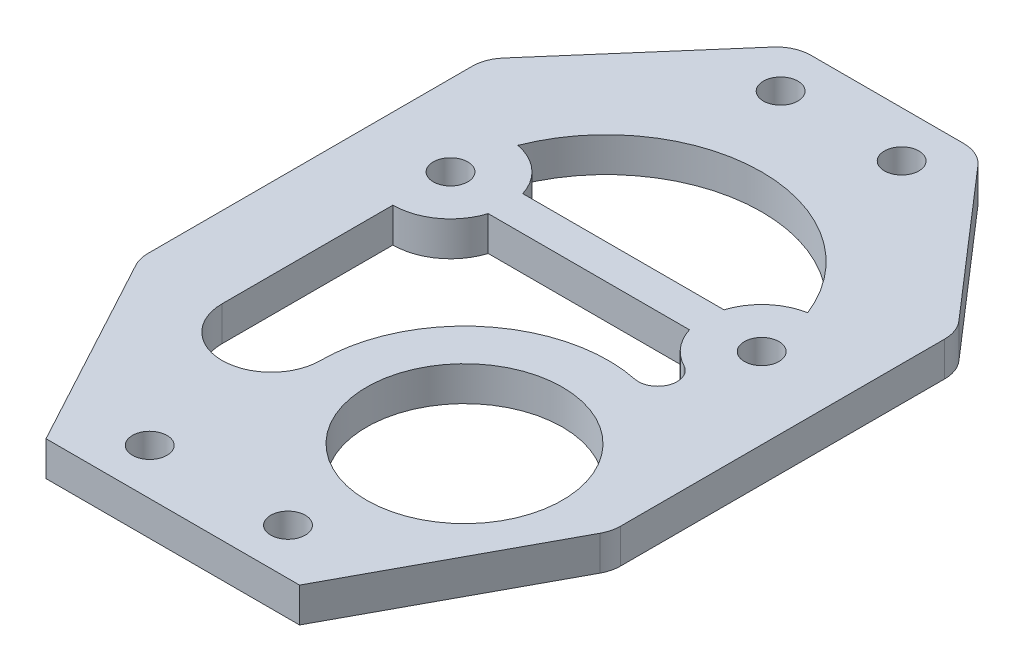
ISO-10303-21;
HEADER;
FILE_DESCRIPTION(('STEP AP214'),'2;1');
FILE_NAME('part.step','',(''),(''),'','','');
FILE_SCHEMA(('AUTOMOTIVE_DESIGN { 1 0 10303 214 1 1 1 1 }'));
ENDSEC;
DATA;
#1=APPLICATION_CONTEXT('core data for automotive mechanical design processes');
#2=APPLICATION_PROTOCOL_DEFINITION('international standard','automotive_design',2000,#1);
#3=PRODUCT_CONTEXT('',#1,'mechanical');
#4=PRODUCT('Part','Part','',(#3));
#5=PRODUCT_RELATED_PRODUCT_CATEGORY('part','',(#4));
#6=PRODUCT_DEFINITION_FORMATION('','',#4);
#7=PRODUCT_DEFINITION_CONTEXT('part definition',#1,'design');
#8=PRODUCT_DEFINITION('design','',#6,#7);
#9=PRODUCT_DEFINITION_SHAPE('','',#8);
#10=(LENGTH_UNIT() NAMED_UNIT(*) SI_UNIT(.MILLI.,.METRE.));
#11=(NAMED_UNIT(*) PLANE_ANGLE_UNIT() SI_UNIT($,.RADIAN.));
#12=(NAMED_UNIT(*) SI_UNIT($,.STERADIAN.) SOLID_ANGLE_UNIT());
#13=UNCERTAINTY_MEASURE_WITH_UNIT(LENGTH_MEASURE(1.E-05),#10,'distance_accuracy_value','');
#14=(GEOMETRIC_REPRESENTATION_CONTEXT(3) GLOBAL_UNCERTAINTY_ASSIGNED_CONTEXT((#13)) GLOBAL_UNIT_ASSIGNED_CONTEXT((#10,
#11,#12)) REPRESENTATION_CONTEXT('',''));
#15=CARTESIAN_POINT('',(0.,0.,0.));
#16=DIRECTION('',(0.,0.,1.));
#17=DIRECTION('',(1.,0.,0.));
#18=AXIS2_PLACEMENT_3D('',#15,#16,#17);
#19=CARTESIAN_POINT('',(0.,1.5,0.));
#20=DIRECTION('',(0.,-1.,0.));
#21=DIRECTION('',(0.,0.,-1.));
#22=AXIS2_PLACEMENT_3D('',#19,#20,#21);
#23=PLANE('',#22);
#24=CARTESIAN_POINT('',(13.5,1.5,0.));
#25=DIRECTION('',(0.,1.,0.));
#26=DIRECTION('',(0.,0.,1.));
#27=AXIS2_PLACEMENT_3D('',#24,#25,#26);
#28=CIRCLE('',#27,1.5);
#29=CARTESIAN_POINT('',(13.5,1.5,1.5));
#30=VERTEX_POINT('',#29);
#31=EDGE_CURVE('E267',#30,#30,#28,.T.);
#32=ORIENTED_EDGE('',*,*,#31,.F.);
#33=EDGE_LOOP('',(#32));
#34=FACE_BOUND('',#33,.T.);
#35=CARTESIAN_POINT('',(-13.5,1.5,0.));
#36=DIRECTION('',(0.,1.,0.));
#37=DIRECTION('',(0.,0.,1.));
#38=AXIS2_PLACEMENT_3D('',#35,#36,#37);
#39=CIRCLE('',#38,1.5);
#40=CARTESIAN_POINT('',(-13.5,1.5,1.5));
#41=VERTEX_POINT('',#40);
#42=EDGE_CURVE('E273',#41,#41,#39,.T.);
#43=ORIENTED_EDGE('',*,*,#42,.F.);
#44=EDGE_LOOP('',(#43));
#45=FACE_BOUND('',#44,.T.);
#46=CARTESIAN_POINT('',(13.5,1.5,0.));
#47=DIRECTION('',(0.,-1.,0.));
#48=DIRECTION('',(0.,0.,1.));
#49=AXIS2_PLACEMENT_3D('',#46,#47,#48);
#50=CIRCLE('',#49,5.);
#51=CARTESIAN_POINT('',(8.73030399291527,1.5,-1.5));
#52=VERTEX_POINT('',#51);
#53=CARTESIAN_POINT('',(12.5740740740741,1.5,-4.91351820793393));
#54=VERTEX_POINT('',#53);
#55=EDGE_CURVE('E279',#52,#54,#50,.T.);
#56=ORIENTED_EDGE('',*,*,#55,.F.);
#57=DIRECTION('',(1.,0.,0.));
#58=VECTOR('',#57,1.);
#59=CARTESIAN_POINT('',(8.73030399291527,1.5,-1.5));
#60=LINE('',#59,#58);
#61=CARTESIAN_POINT('',(-8.73030399291527,1.5,-1.5));
#62=VERTEX_POINT('',#61);
#63=EDGE_CURVE('E287',#62,#52,#60,.T.);
#64=ORIENTED_EDGE('',*,*,#63,.F.);
#65=CARTESIAN_POINT('',(-13.5,1.5,0.));
#66=DIRECTION('',(0.,-1.,0.));
#67=DIRECTION('',(0.,0.,1.));
#68=AXIS2_PLACEMENT_3D('',#65,#66,#67);
#69=CIRCLE('',#68,5.);
#70=CARTESIAN_POINT('',(-12.5740740740741,1.5,-4.91351820793393));
#71=VERTEX_POINT('',#70);
#72=EDGE_CURVE('E284',#71,#62,#69,.T.);
#73=ORIENTED_EDGE('',*,*,#72,.F.);
#74=CARTESIAN_POINT('',(0.,1.5,0.));
#75=DIRECTION('',(0.,1.,0.));
#76=DIRECTION('',(0.,0.,1.));
#77=AXIS2_PLACEMENT_3D('',#74,#75,#76);
#78=CIRCLE('',#77,13.5);
#79=EDGE_CURVE('E281',#54,#71,#78,.T.);
#80=ORIENTED_EDGE('',*,*,#79,.F.);
#81=EDGE_LOOP('',(#56,#64,#73,#80));
#82=FACE_BOUND('',#81,.T.);
#83=DIRECTION('',(0.,0.,1.));
#84=VECTOR('',#83,1.);
#85=CARTESIAN_POINT('',(-20.5,1.5,-10.));
#86=LINE('',#85,#84);
#87=CARTESIAN_POINT('',(-20.5,1.5,-8.87956217000711));
#88=VERTEX_POINT('',#87);
#89=CARTESIAN_POINT('',(-20.5,1.5,19.2420155495152));
#90=VERTEX_POINT('',#89);
#91=EDGE_CURVE('E351',#88,#90,#86,.T.);
#92=ORIENTED_EDGE('',*,*,#91,.T.);
#93=CARTESIAN_POINT('',(-17.5,1.5,19.2420155495152));
#94=DIRECTION('',(0.,-1.,0.));
#95=DIRECTION('',(0.,0.,-1.));
#96=AXIS2_PLACEMENT_3D('',#93,#94,#95);
#97=CIRCLE('',#96,3.);
#98=CARTESIAN_POINT('',(-20.1399573860197,1.5,20.6670155495152));
#99=VERTEX_POINT('',#98);
#100=EDGE_CURVE('E411',#90,#99,#97,.F.);
#101=ORIENTED_EDGE('',*,*,#100,.T.);
#102=DIRECTION('',(0.475,0.,0.879985795339902));
#103=VECTOR('',#102,1.);
#104=CARTESIAN_POINT('',(-20.5,1.5,20.));
#105=LINE('',#104,#103);
#106=CARTESIAN_POINT('',(-11.,1.5,37.599715906798));
#107=VERTEX_POINT('',#106);
#108=EDGE_CURVE('E354',#99,#107,#105,.T.);
#109=ORIENTED_EDGE('',*,*,#108,.T.);
#110=DIRECTION('',(1.,0.,0.));
#111=VECTOR('',#110,1.);
#112=CARTESIAN_POINT('',(-11.,1.5,37.599715906798));
#113=LINE('',#112,#111);
#114=CARTESIAN_POINT('',(11.,1.5,37.599715906798));
#115=VERTEX_POINT('',#114);
#116=EDGE_CURVE('E334',#107,#115,#113,.T.);
#117=ORIENTED_EDGE('',*,*,#116,.T.);
#118=DIRECTION('',(0.475,0.,-0.879985795339902));
#119=VECTOR('',#118,1.);
#120=CARTESIAN_POINT('',(20.5,1.5,20.));
#121=LINE('',#120,#119);
#122=CARTESIAN_POINT('',(20.1399573860197,1.5,20.6670155495152));
#123=VERTEX_POINT('',#122);
#124=EDGE_CURVE('E337',#115,#123,#121,.T.);
#125=ORIENTED_EDGE('',*,*,#124,.T.);
#126=CARTESIAN_POINT('',(17.5,1.5,19.2420155495152));
#127=DIRECTION('',(0.,-1.,0.));
#128=DIRECTION('',(0.,0.,-1.));
#129=AXIS2_PLACEMENT_3D('',#126,#127,#128);
#130=CIRCLE('',#129,3.);
#131=CARTESIAN_POINT('',(20.5,1.5,19.2420155495152));
#132=VERTEX_POINT('',#131);
#133=EDGE_CURVE('E402',#123,#132,#130,.F.);
#134=ORIENTED_EDGE('',*,*,#133,.T.);
#135=DIRECTION('',(0.,0.,-1.));
#136=VECTOR('',#135,1.);
#137=CARTESIAN_POINT('',(20.5,1.5,-10.));
#138=LINE('',#137,#136);
#139=CARTESIAN_POINT('',(20.5,1.5,-8.87956217000711));
#140=VERTEX_POINT('',#139);
#141=EDGE_CURVE('E341',#132,#140,#138,.T.);
#142=ORIENTED_EDGE('',*,*,#141,.T.);
#143=CARTESIAN_POINT('',(17.5,1.5,-8.87956217000711));
#144=DIRECTION('',(0.,-1.,0.));
#145=DIRECTION('',(0.,0.,-1.));
#146=AXIS2_PLACEMENT_3D('',#143,#144,#145);
#147=CIRCLE('',#146,3.);
#148=CARTESIAN_POINT('',(19.7655284444291,1.5,-10.8461279246878));
#149=VERTEX_POINT('',#148);
#150=EDGE_CURVE('E404',#140,#149,#147,.F.);
#151=ORIENTED_EDGE('',*,*,#150,.T.);
#152=DIRECTION('',(-0.655521918226887,0.,-0.755176148143029));
#153=VECTOR('',#152,1.);
#154=CARTESIAN_POINT('',(8.,1.5,-24.400284093202));
#155=LINE('',#154,#153);
#156=CARTESIAN_POINT('',(8.89706064011543,1.5,-23.3668498478826));
#157=VERTEX_POINT('',#156);
#158=EDGE_CURVE('E344',#149,#157,#155,.T.);
#159=ORIENTED_EDGE('',*,*,#158,.T.);
#160=CARTESIAN_POINT('',(6.63153219568634,1.5,-21.400284093202));
#161=DIRECTION('',(0.,-1.,0.));
#162=DIRECTION('',(0.,0.,-1.));
#163=AXIS2_PLACEMENT_3D('',#160,#161,#162);
#164=CIRCLE('',#163,3.);
#165=CARTESIAN_POINT('',(6.63153219568634,1.5,-24.400284093202));
#166=VERTEX_POINT('',#165);
#167=EDGE_CURVE('E406',#157,#166,#164,.F.);
#168=ORIENTED_EDGE('',*,*,#167,.T.);
#169=DIRECTION('',(-1.,0.,0.));
#170=VECTOR('',#169,1.);
#171=CARTESIAN_POINT('',(8.,1.5,-24.400284093202));
#172=LINE('',#171,#170);
#173=CARTESIAN_POINT('',(-6.63153219568634,1.5,-24.400284093202));
#174=VERTEX_POINT('',#173);
#175=EDGE_CURVE('E347',#166,#174,#172,.T.);
#176=ORIENTED_EDGE('',*,*,#175,.T.);
#177=CARTESIAN_POINT('',(-6.63153219568634,1.5,-21.400284093202));
#178=DIRECTION('',(0.,-1.,0.));
#179=DIRECTION('',(0.,0.,-1.));
#180=AXIS2_PLACEMENT_3D('',#177,#178,#179);
#181=CIRCLE('',#180,3.);
#182=CARTESIAN_POINT('',(-8.89706064011543,1.5,-23.3668498478826));
#183=VERTEX_POINT('',#182);
#184=EDGE_CURVE('E54',#174,#183,#181,.F.);
#185=ORIENTED_EDGE('',*,*,#184,.T.);
#186=DIRECTION('',(-0.655521918226887,0.,0.755176148143029));
#187=VECTOR('',#186,1.);
#188=CARTESIAN_POINT('',(-8.,1.5,-24.400284093202));
#189=LINE('',#188,#187);
#190=CARTESIAN_POINT('',(-19.7655284444291,1.5,-10.8461279246878));
#191=VERTEX_POINT('',#190);
#192=EDGE_CURVE('E349',#183,#191,#189,.T.);
#193=ORIENTED_EDGE('',*,*,#192,.T.);
#194=CARTESIAN_POINT('',(-17.5,1.5,-8.87956217000711));
#195=DIRECTION('',(0.,-1.,0.));
#196=DIRECTION('',(0.,0.,-1.));
#197=AXIS2_PLACEMENT_3D('',#194,#195,#196);
#198=CIRCLE('',#197,3.);
#199=EDGE_CURVE('E409',#191,#88,#198,.F.);
#200=ORIENTED_EDGE('',*,*,#199,.T.);
#201=EDGE_LOOP('',(#92,#101,#109,#117,#125,#134,#142,#151,#159,#168,#176,#185,#193,#200));
#202=FACE_BOUND('',#201,.T.);
#203=CARTESIAN_POINT('',(-5.25,1.5,-20.3945458395131));
#204=DIRECTION('',(0.,1.,0.));
#205=DIRECTION('',(0.,0.,1.));
#206=AXIS2_PLACEMENT_3D('',#203,#204,#205);
#207=CIRCLE('',#206,1.5);
#208=CARTESIAN_POINT('',(-5.25,1.5,-18.8945458395131));
#209=VERTEX_POINT('',#208);
#210=EDGE_CURVE('E328',#209,#209,#207,.T.);
#211=ORIENTED_EDGE('',*,*,#210,.F.);
#212=EDGE_LOOP('',(#211));
#213=FACE_BOUND('',#212,.T.);
#214=CARTESIAN_POINT('',(-5.99999999999999,1.5,33.599715906798));
#215=DIRECTION('',(0.,1.,0.));
#216=DIRECTION('',(0.,0.,1.));
#217=AXIS2_PLACEMENT_3D('',#214,#215,#216);
#218=CIRCLE('',#217,1.5);
#219=CARTESIAN_POINT('',(-5.99999999999999,1.5,35.099715906798));
#220=VERTEX_POINT('',#219);
#221=EDGE_CURVE('E322',#220,#220,#218,.T.);
#222=ORIENTED_EDGE('',*,*,#221,.F.);
#223=EDGE_LOOP('',(#222));
#224=FACE_BOUND('',#223,.T.);
#225=CARTESIAN_POINT('',(6.,1.5,33.599715906798));
#226=DIRECTION('',(0.,1.,0.));
#227=DIRECTION('',(0.,0.,-1.));
#228=AXIS2_PLACEMENT_3D('',#225,#226,#227);
#229=CIRCLE('',#228,1.5);
#230=CARTESIAN_POINT('',(6.,1.5,32.099715906798));
#231=VERTEX_POINT('',#230);
#232=EDGE_CURVE('E316',#231,#231,#229,.T.);
#233=ORIENTED_EDGE('',*,*,#232,.F.);
#234=EDGE_LOOP('',(#233));
#235=FACE_BOUND('',#234,.T.);
#236=CARTESIAN_POINT('',(5.25,1.5,-20.3945458395131));
#237=DIRECTION('',(0.,1.,0.));
#238=DIRECTION('',(0.,0.,-1.));
#239=AXIS2_PLACEMENT_3D('',#236,#237,#238);
#240=CIRCLE('',#239,1.5);
#241=CARTESIAN_POINT('',(5.25,1.5,-21.8945458395131));
#242=VERTEX_POINT('',#241);
#243=EDGE_CURVE('E310',#242,#242,#240,.T.);
#244=ORIENTED_EDGE('',*,*,#243,.F.);
#245=EDGE_LOOP('',(#244));
#246=FACE_BOUND('',#245,.T.);
#247=CARTESIAN_POINT('',(-9.23491832320444,1.5,19.8174147720394));
#248=DIRECTION('',(0.,1.,0.));
#249=DIRECTION('',(0.,0.,1.));
#250=AXIS2_PLACEMENT_3D('',#247,#248,#249);
#251=CIRCLE('',#250,4.26508167679556);
#252=CARTESIAN_POINT('',(-13.5,1.5,19.8174147720394));
#253=VERTEX_POINT('',#252);
#254=CARTESIAN_POINT('',(-4.96983664640886,1.5,19.8174147720394));
#255=VERTEX_POINT('',#254);
#256=EDGE_CURVE('E201',#253,#255,#251,.T.);
#257=ORIENTED_EDGE('',*,*,#256,.F.);
#258=DIRECTION('',(0.,0.,1.));
#259=VECTOR('',#258,1.);
#260=CARTESIAN_POINT('',(-13.5,1.5,5.));
#261=LINE('',#260,#259);
#262=CARTESIAN_POINT('',(-13.5,1.5,5.));
#263=VERTEX_POINT('',#262);
#264=EDGE_CURVE('E237',#263,#253,#261,.T.);
#265=ORIENTED_EDGE('',*,*,#264,.F.);
#266=CARTESIAN_POINT('',(-13.5,1.5,0.));
#267=DIRECTION('',(0.,-1.,0.));
#268=DIRECTION('',(0.,0.,1.));
#269=AXIS2_PLACEMENT_3D('',#266,#267,#268);
#270=CIRCLE('',#269,5.);
#271=CARTESIAN_POINT('',(-8.73030399291527,1.5,1.5));
#272=VERTEX_POINT('',#271);
#273=EDGE_CURVE('E234',#272,#263,#270,.T.);
#274=ORIENTED_EDGE('',*,*,#273,.F.);
#275=DIRECTION('',(-1.,0.,0.));
#276=VECTOR('',#275,1.);
#277=CARTESIAN_POINT('',(8.73030399291527,1.5,1.5));
#278=LINE('',#277,#276);
#279=CARTESIAN_POINT('',(8.73030399291527,1.5,1.5));
#280=VERTEX_POINT('',#279);
#281=EDGE_CURVE('E232',#280,#272,#278,.T.);
#282=ORIENTED_EDGE('',*,*,#281,.F.);
#283=CARTESIAN_POINT('',(13.5,1.5,0.));
#284=DIRECTION('',(0.,-1.,0.));
#285=DIRECTION('',(0.,0.,1.));
#286=AXIS2_PLACEMENT_3D('',#283,#284,#285);
#287=CIRCLE('',#286,5.);
#288=CARTESIAN_POINT('',(11.1879757809718,1.5,4.43334456258784));
#289=VERTEX_POINT('',#288);
#290=EDGE_CURVE('E227',#289,#280,#287,.T.);
#291=ORIENTED_EDGE('',*,*,#290,.F.);
#292=CARTESIAN_POINT('',(10.4087781028521,1.5,5.92746895844948));
#293=DIRECTION('',(0.,1.,0.));
#294=DIRECTION('',(0.,0.,1.));
#295=AXIS2_PLACEMENT_3D('',#292,#293,#294);
#296=CIRCLE('',#295,1.68509843388926);
#297=CARTESIAN_POINT('',(10.0668171902538,1.5,7.57750515991627));
#298=VERTEX_POINT('',#297);
#299=EDGE_CURVE('E225',#298,#289,#296,.T.);
#300=ORIENTED_EDGE('',*,*,#299,.F.);
#301=CARTESIAN_POINT('',(7.53016335359115,1.5,19.8174147720394));
#302=DIRECTION('',(0.,-1.,0.));
#303=DIRECTION('',(0.,0.,-1.));
#304=AXIS2_PLACEMENT_3D('',#301,#302,#303);
#305=CIRCLE('',#304,12.5);
#306=EDGE_CURVE('E211',#255,#298,#305,.T.);
#307=ORIENTED_EDGE('',*,*,#306,.F.);
#308=EDGE_LOOP('',(#257,#265,#274,#282,#291,#300,#307));
#309=FACE_BOUND('',#308,.T.);
#310=CARTESIAN_POINT('',(7.53016335359115,1.5,19.8174147720394));
#311=DIRECTION('',(0.,1.,0.));
#312=DIRECTION('',(0.,0.,1.));
#313=AXIS2_PLACEMENT_3D('',#310,#311,#312);
#314=CIRCLE('',#313,8.5);
#315=CARTESIAN_POINT('',(7.53016335359115,1.5,28.3174147720394));
#316=VERTEX_POINT('',#315);
#317=EDGE_CURVE('E241',#316,#316,#314,.T.);
#318=ORIENTED_EDGE('',*,*,#317,.F.);
#319=EDGE_LOOP('',(#318));
#320=FACE_BOUND('',#319,.T.);
#321=ADVANCED_FACE('F32',(#34,#45,#82,#202,#213,#224,#235,#246,#309,#320),#23,.F.);
#322=CARTESIAN_POINT('',(0.,-1.5,0.));
#323=DIRECTION('',(0.,-1.,0.));
#324=DIRECTION('',(0.,0.,-1.));
#325=AXIS2_PLACEMENT_3D('',#322,#323,#324);
#326=PLANE('',#325);
#327=DIRECTION('',(0.,0.,1.));
#328=VECTOR('',#327,1.);
#329=CARTESIAN_POINT('',(-13.5,-1.5,5.));
#330=LINE('',#329,#328);
#331=CARTESIAN_POINT('',(-13.5,-1.5,5.));
#332=VERTEX_POINT('',#331);
#333=CARTESIAN_POINT('',(-13.5,-1.5,19.8174147720394));
#334=VERTEX_POINT('',#333);
#335=EDGE_CURVE('E212',#332,#334,#330,.T.);
#336=ORIENTED_EDGE('',*,*,#335,.T.);
#337=CARTESIAN_POINT('',(-9.23491832320444,-1.5,19.8174147720394));
#338=DIRECTION('',(0.,1.,0.));
#339=DIRECTION('',(0.,0.,1.));
#340=AXIS2_PLACEMENT_3D('',#337,#338,#339);
#341=CIRCLE('',#340,4.26508167679556);
#342=CARTESIAN_POINT('',(-4.96983664640886,-1.5,19.8174147720394));
#343=VERTEX_POINT('',#342);
#344=EDGE_CURVE('E239',#334,#343,#341,.T.);
#345=ORIENTED_EDGE('',*,*,#344,.T.);
#346=CARTESIAN_POINT('',(7.53016335359115,-1.5,19.8174147720394));
#347=DIRECTION('',(0.,-1.,0.));
#348=DIRECTION('',(0.,0.,-1.));
#349=AXIS2_PLACEMENT_3D('',#346,#347,#348);
#350=CIRCLE('',#349,12.5);
#351=CARTESIAN_POINT('',(10.0668171902538,-1.5,7.57750515991627));
#352=VERTEX_POINT('',#351);
#353=EDGE_CURVE('E218',#343,#352,#350,.T.);
#354=ORIENTED_EDGE('',*,*,#353,.T.);
#355=CARTESIAN_POINT('',(10.4087781028521,-1.5,5.92746895844948));
#356=DIRECTION('',(0.,1.,0.));
#357=DIRECTION('',(0.,0.,1.));
#358=AXIS2_PLACEMENT_3D('',#355,#356,#357);
#359=CIRCLE('',#358,1.68509843388926);
#360=CARTESIAN_POINT('',(11.1879757809718,-1.5,4.43334456258784));
#361=VERTEX_POINT('',#360);
#362=EDGE_CURVE('E243',#352,#361,#359,.T.);
#363=ORIENTED_EDGE('',*,*,#362,.T.);
#364=CARTESIAN_POINT('',(13.5,-1.5,0.));
#365=DIRECTION('',(0.,-1.,0.));
#366=DIRECTION('',(0.,0.,1.));
#367=AXIS2_PLACEMENT_3D('',#364,#365,#366);
#368=CIRCLE('',#367,5.);
#369=CARTESIAN_POINT('',(8.73030399291527,-1.5,1.5));
#370=VERTEX_POINT('',#369);
#371=EDGE_CURVE('E246',#361,#370,#368,.T.);
#372=ORIENTED_EDGE('',*,*,#371,.T.);
#373=DIRECTION('',(-1.,0.,0.));
#374=VECTOR('',#373,1.);
#375=CARTESIAN_POINT('',(8.73030399291527,-1.5,1.5));
#376=LINE('',#375,#374);
#377=CARTESIAN_POINT('',(-8.73030399291527,-1.5,1.5));
#378=VERTEX_POINT('',#377);
#379=EDGE_CURVE('E249',#370,#378,#376,.T.);
#380=ORIENTED_EDGE('',*,*,#379,.T.);
#381=CARTESIAN_POINT('',(-13.5,-1.5,0.));
#382=DIRECTION('',(0.,-1.,0.));
#383=DIRECTION('',(0.,0.,1.));
#384=AXIS2_PLACEMENT_3D('',#381,#382,#383);
#385=CIRCLE('',#384,5.);
#386=EDGE_CURVE('E252',#378,#332,#385,.T.);
#387=ORIENTED_EDGE('',*,*,#386,.T.);
#388=EDGE_LOOP('',(#336,#345,#354,#363,#372,#380,#387));
#389=FACE_BOUND('',#388,.T.);
#390=CARTESIAN_POINT('',(13.5,-1.5,0.));
#391=DIRECTION('',(0.,1.,0.));
#392=DIRECTION('',(0.,0.,1.));
#393=AXIS2_PLACEMENT_3D('',#390,#391,#392);
#394=CIRCLE('',#393,1.5);
#395=CARTESIAN_POINT('',(13.5,-1.5,1.5));
#396=VERTEX_POINT('',#395);
#397=EDGE_CURVE('E219',#396,#396,#394,.T.);
#398=ORIENTED_EDGE('',*,*,#397,.T.);
#399=EDGE_LOOP('',(#398));
#400=FACE_BOUND('',#399,.T.);
#401=DIRECTION('',(1.,0.,0.));
#402=VECTOR('',#401,1.);
#403=CARTESIAN_POINT('',(8.73030399291527,-1.5,-1.5));
#404=LINE('',#403,#402);
#405=CARTESIAN_POINT('',(-8.73030399291527,-1.5,-1.5));
#406=VERTEX_POINT('',#405);
#407=CARTESIAN_POINT('',(8.73030399291527,-1.5,-1.5));
#408=VERTEX_POINT('',#407);
#409=EDGE_CURVE('E282',#406,#408,#404,.T.);
#410=ORIENTED_EDGE('',*,*,#409,.T.);
#411=CARTESIAN_POINT('',(13.5,-1.5,0.));
#412=DIRECTION('',(0.,-1.,0.));
#413=DIRECTION('',(0.,0.,1.));
#414=AXIS2_PLACEMENT_3D('',#411,#412,#413);
#415=CIRCLE('',#414,5.);
#416=CARTESIAN_POINT('',(12.5740740740741,-1.5,-4.91351820793393));
#417=VERTEX_POINT('',#416);
#418=EDGE_CURVE('E276',#408,#417,#415,.T.);
#419=ORIENTED_EDGE('',*,*,#418,.T.);
#420=CARTESIAN_POINT('',(0.,-1.5,0.));
#421=DIRECTION('',(0.,1.,0.));
#422=DIRECTION('',(0.,0.,1.));
#423=AXIS2_PLACEMENT_3D('',#420,#421,#422);
#424=CIRCLE('',#423,13.5);
#425=CARTESIAN_POINT('',(-12.5740740740741,-1.5,-4.91351820793393));
#426=VERTEX_POINT('',#425);
#427=EDGE_CURVE('E292',#417,#426,#424,.T.);
#428=ORIENTED_EDGE('',*,*,#427,.T.);
#429=CARTESIAN_POINT('',(-13.5,-1.5,0.));
#430=DIRECTION('',(0.,-1.,0.));
#431=DIRECTION('',(0.,0.,1.));
#432=AXIS2_PLACEMENT_3D('',#429,#430,#431);
#433=CIRCLE('',#432,5.);
#434=EDGE_CURVE('E295',#426,#406,#433,.T.);
#435=ORIENTED_EDGE('',*,*,#434,.T.);
#436=EDGE_LOOP('',(#410,#419,#428,#435));
#437=FACE_BOUND('',#436,.T.);
#438=CARTESIAN_POINT('',(5.25,-1.5,-20.3945458395131));
#439=DIRECTION('',(0.,1.,0.));
#440=DIRECTION('',(0.,0.,-1.));
#441=AXIS2_PLACEMENT_3D('',#438,#439,#440);
#442=CIRCLE('',#441,1.5);
#443=CARTESIAN_POINT('',(5.25,-1.5,-21.8945458395131));
#444=VERTEX_POINT('',#443);
#445=EDGE_CURVE('E309',#444,#444,#442,.T.);
#446=ORIENTED_EDGE('',*,*,#445,.T.);
#447=EDGE_LOOP('',(#446));
#448=FACE_BOUND('',#447,.T.);
#449=CARTESIAN_POINT('',(-5.99999999999999,-1.5,33.599715906798));
#450=DIRECTION('',(0.,1.,0.));
#451=DIRECTION('',(0.,0.,1.));
#452=AXIS2_PLACEMENT_3D('',#449,#450,#451);
#453=CIRCLE('',#452,1.5);
#454=CARTESIAN_POINT('',(-5.99999999999999,-1.5,35.099715906798));
#455=VERTEX_POINT('',#454);
#456=EDGE_CURVE('E319',#455,#455,#453,.T.);
#457=ORIENTED_EDGE('',*,*,#456,.T.);
#458=EDGE_LOOP('',(#457));
#459=FACE_BOUND('',#458,.T.);
#460=DIRECTION('',(0.475,0.,0.879985795339902));
#461=VECTOR('',#460,1.);
#462=CARTESIAN_POINT('',(-20.5,-1.5,20.));
#463=LINE('',#462,#461);
#464=CARTESIAN_POINT('',(-20.1399573860197,-1.5,20.6670155495152));
#465=VERTEX_POINT('',#464);
#466=CARTESIAN_POINT('',(-11.,-1.5,37.599715906798));
#467=VERTEX_POINT('',#466);
#468=EDGE_CURVE('E338',#465,#467,#463,.T.);
#469=ORIENTED_EDGE('',*,*,#468,.F.);
#470=CARTESIAN_POINT('',(-17.5,-1.5,19.2420155495152));
#471=DIRECTION('',(0.,-1.,0.));
#472=DIRECTION('',(0.,0.,-1.));
#473=AXIS2_PLACEMENT_3D('',#470,#471,#472);
#474=CIRCLE('',#473,3.);
#475=CARTESIAN_POINT('',(-20.5,-1.5,19.2420155495152));
#476=VERTEX_POINT('',#475);
#477=EDGE_CURVE('E395',#465,#476,#474,.T.);
#478=ORIENTED_EDGE('',*,*,#477,.T.);
#479=DIRECTION('',(0.,0.,1.));
#480=VECTOR('',#479,1.);
#481=CARTESIAN_POINT('',(-20.5,-1.5,-10.));
#482=LINE('',#481,#480);
#483=CARTESIAN_POINT('',(-20.5,-1.5,-8.87956217000711));
#484=VERTEX_POINT('',#483);
#485=EDGE_CURVE('E373',#484,#476,#482,.T.);
#486=ORIENTED_EDGE('',*,*,#485,.F.);
#487=CARTESIAN_POINT('',(-17.5,-1.5,-8.87956217000711));
#488=DIRECTION('',(0.,-1.,0.));
#489=DIRECTION('',(0.,0.,-1.));
#490=AXIS2_PLACEMENT_3D('',#487,#488,#489);
#491=CIRCLE('',#490,3.);
#492=CARTESIAN_POINT('',(-19.7655284444291,-1.5,-10.8461279246878));
#493=VERTEX_POINT('',#492);
#494=EDGE_CURVE('E393',#484,#493,#491,.T.);
#495=ORIENTED_EDGE('',*,*,#494,.T.);
#496=DIRECTION('',(-0.655521918226887,0.,0.755176148143029));
#497=VECTOR('',#496,1.);
#498=CARTESIAN_POINT('',(-8.,-1.5,-24.400284093202));
#499=LINE('',#498,#497);
#500=CARTESIAN_POINT('',(-8.89706064011543,-1.5,-23.3668498478826));
#501=VERTEX_POINT('',#500);
#502=EDGE_CURVE('E371',#501,#493,#499,.T.);
#503=ORIENTED_EDGE('',*,*,#502,.F.);
#504=CARTESIAN_POINT('',(-6.63153219568634,-1.5,-21.400284093202));
#505=DIRECTION('',(0.,-1.,0.));
#506=DIRECTION('',(0.,0.,-1.));
#507=AXIS2_PLACEMENT_3D('',#504,#505,#506);
#508=CIRCLE('',#507,3.);
#509=CARTESIAN_POINT('',(-6.63153219568634,-1.5,-24.400284093202));
#510=VERTEX_POINT('',#509);
#511=EDGE_CURVE('E391',#501,#510,#508,.T.);
#512=ORIENTED_EDGE('',*,*,#511,.T.);
#513=DIRECTION('',(-1.,0.,0.));
#514=VECTOR('',#513,1.);
#515=CARTESIAN_POINT('',(8.,-1.5,-24.400284093202));
#516=LINE('',#515,#514);
#517=CARTESIAN_POINT('',(6.63153219568634,-1.5,-24.400284093202));
#518=VERTEX_POINT('',#517);
#519=EDGE_CURVE('E368',#518,#510,#516,.T.);
#520=ORIENTED_EDGE('',*,*,#519,.F.);
#521=CARTESIAN_POINT('',(6.63153219568634,-1.5,-21.400284093202));
#522=DIRECTION('',(0.,-1.,0.));
#523=DIRECTION('',(0.,0.,-1.));
#524=AXIS2_PLACEMENT_3D('',#521,#522,#523);
#525=CIRCLE('',#524,3.);
#526=CARTESIAN_POINT('',(8.89706064011543,-1.5,-23.3668498478826));
#527=VERTEX_POINT('',#526);
#528=EDGE_CURVE('E389',#518,#527,#525,.T.);
#529=ORIENTED_EDGE('',*,*,#528,.T.);
#530=DIRECTION('',(-0.655521918226887,0.,-0.755176148143029));
#531=VECTOR('',#530,1.);
#532=CARTESIAN_POINT('',(8.,-1.5,-24.400284093202));
#533=LINE('',#532,#531);
#534=CARTESIAN_POINT('',(19.7655284444291,-1.5,-10.8461279246878));
#535=VERTEX_POINT('',#534);
#536=EDGE_CURVE('E365',#535,#527,#533,.T.);
#537=ORIENTED_EDGE('',*,*,#536,.F.);
#538=CARTESIAN_POINT('',(17.5,-1.5,-8.87956217000711));
#539=DIRECTION('',(0.,-1.,0.));
#540=DIRECTION('',(0.,0.,-1.));
#541=AXIS2_PLACEMENT_3D('',#538,#539,#540);
#542=CIRCLE('',#541,3.);
#543=CARTESIAN_POINT('',(20.5,-1.5,-8.87956217000711));
#544=VERTEX_POINT('',#543);
#545=EDGE_CURVE('E387',#535,#544,#542,.T.);
#546=ORIENTED_EDGE('',*,*,#545,.T.);
#547=DIRECTION('',(0.,0.,-1.));
#548=VECTOR('',#547,1.);
#549=CARTESIAN_POINT('',(20.5,-1.5,-10.));
#550=LINE('',#549,#548);
#551=CARTESIAN_POINT('',(20.5,-1.5,19.2420155495152));
#552=VERTEX_POINT('',#551);
#553=EDGE_CURVE('E362',#552,#544,#550,.T.);
#554=ORIENTED_EDGE('',*,*,#553,.F.);
#555=CARTESIAN_POINT('',(17.5,-1.5,19.2420155495152));
#556=DIRECTION('',(0.,-1.,0.));
#557=DIRECTION('',(0.,0.,-1.));
#558=AXIS2_PLACEMENT_3D('',#555,#556,#557);
#559=CIRCLE('',#558,3.);
#560=CARTESIAN_POINT('',(20.1399573860197,-1.5,20.6670155495152));
#561=VERTEX_POINT('',#560);
#562=EDGE_CURVE('E385',#552,#561,#559,.T.);
#563=ORIENTED_EDGE('',*,*,#562,.T.);
#564=DIRECTION('',(0.475,0.,-0.879985795339902));
#565=VECTOR('',#564,1.);
#566=CARTESIAN_POINT('',(20.5,-1.5,20.));
#567=LINE('',#566,#565);
#568=CARTESIAN_POINT('',(11.,-1.5,37.599715906798));
#569=VERTEX_POINT('',#568);
#570=EDGE_CURVE('E359',#569,#561,#567,.T.);
#571=ORIENTED_EDGE('',*,*,#570,.F.);
#572=DIRECTION('',(1.,0.,0.));
#573=VECTOR('',#572,1.);
#574=CARTESIAN_POINT('',(-11.,-1.5,37.599715906798));
#575=LINE('',#574,#573);
#576=EDGE_CURVE('E331',#467,#569,#575,.T.);
#577=ORIENTED_EDGE('',*,*,#576,.F.);
#578=EDGE_LOOP('',(#469,#478,#486,#495,#503,#512,#520,#529,#537,#546,#554,#563,#571,#577));
#579=FACE_BOUND('',#578,.T.);
#580=CARTESIAN_POINT('',(-5.25,-1.5,-20.3945458395131));
#581=DIRECTION('',(0.,1.,0.));
#582=DIRECTION('',(0.,0.,1.));
#583=AXIS2_PLACEMENT_3D('',#580,#581,#582);
#584=CIRCLE('',#583,1.5);
#585=CARTESIAN_POINT('',(-5.25,-1.5,-18.8945458395131));
#586=VERTEX_POINT('',#585);
#587=EDGE_CURVE('E325',#586,#586,#584,.T.);
#588=ORIENTED_EDGE('',*,*,#587,.T.);
#589=EDGE_LOOP('',(#588));
#590=FACE_BOUND('',#589,.T.);
#591=CARTESIAN_POINT('',(6.,-1.5,33.599715906798));
#592=DIRECTION('',(0.,1.,0.));
#593=DIRECTION('',(0.,0.,-1.));
#594=AXIS2_PLACEMENT_3D('',#591,#592,#593);
#595=CIRCLE('',#594,1.5);
#596=CARTESIAN_POINT('',(6.,-1.5,32.099715906798));
#597=VERTEX_POINT('',#596);
#598=EDGE_CURVE('E313',#597,#597,#595,.T.);
#599=ORIENTED_EDGE('',*,*,#598,.T.);
#600=EDGE_LOOP('',(#599));
#601=FACE_BOUND('',#600,.T.);
#602=CARTESIAN_POINT('',(-13.5,-1.5,0.));
#603=DIRECTION('',(0.,1.,0.));
#604=DIRECTION('',(0.,0.,1.));
#605=AXIS2_PLACEMENT_3D('',#602,#603,#604);
#606=CIRCLE('',#605,1.5);
#607=CARTESIAN_POINT('',(-13.5,-1.5,1.5));
#608=VERTEX_POINT('',#607);
#609=EDGE_CURVE('E270',#608,#608,#606,.T.);
#610=ORIENTED_EDGE('',*,*,#609,.T.);
#611=EDGE_LOOP('',(#610));
#612=FACE_BOUND('',#611,.T.);
#613=CARTESIAN_POINT('',(7.53016335359115,-1.5,19.8174147720394));
#614=DIRECTION('',(0.,1.,0.));
#615=DIRECTION('',(0.,0.,1.));
#616=AXIS2_PLACEMENT_3D('',#613,#614,#615);
#617=CIRCLE('',#616,8.5);
#618=CARTESIAN_POINT('',(7.53016335359115,-1.5,28.3174147720394));
#619=VERTEX_POINT('',#618);
#620=EDGE_CURVE('E801',#619,#619,#617,.T.);
#621=ORIENTED_EDGE('',*,*,#620,.T.);
#622=EDGE_LOOP('',(#621));
#623=FACE_BOUND('',#622,.T.);
#624=ADVANCED_FACE('F448',(#389,#400,#437,#448,#459,#579,#590,#601,#612,#623),#326,.T.);
#625=CARTESIAN_POINT('',(-11.,1.5,37.599715906798));
#626=DIRECTION('',(0.,0.,-1.));
#627=DIRECTION('',(-1.,0.,0.));
#628=AXIS2_PLACEMENT_3D('',#625,#626,#627);
#629=PLANE('',#628);
#630=ORIENTED_EDGE('',*,*,#576,.T.);
#631=DIRECTION('',(0.,-1.,0.));
#632=VECTOR('',#631,1.);
#633=CARTESIAN_POINT('',(11.,1.5,37.599715906798));
#634=LINE('',#633,#632);
#635=EDGE_CURVE('E379',#115,#569,#634,.T.);
#636=ORIENTED_EDGE('',*,*,#635,.F.);
#637=ORIENTED_EDGE('',*,*,#116,.F.);
#638=DIRECTION('',(0.,-1.,0.));
#639=VECTOR('',#638,1.);
#640=CARTESIAN_POINT('',(-11.,1.5,37.599715906798));
#641=LINE('',#640,#639);
#642=EDGE_CURVE('E356',#107,#467,#641,.T.);
#643=ORIENTED_EDGE('',*,*,#642,.T.);
#644=EDGE_LOOP('',(#630,#636,#637,#643));
#645=FACE_BOUND('',#644,.T.);
#646=ADVANCED_FACE('F484',(#645),#629,.F.);
#647=CARTESIAN_POINT('',(20.5,1.5,20.));
#648=DIRECTION('',(-0.879985795339902,0.,-0.475));
#649=DIRECTION('',(-0.475,0.,0.879985795339902));
#650=AXIS2_PLACEMENT_3D('',#647,#648,#649);
#651=PLANE('',#650);
#652=ORIENTED_EDGE('',*,*,#570,.T.);
#653=DIRECTION('',(0.,-1.,0.));
#654=VECTOR('',#653,1.);
#655=CARTESIAN_POINT('',(20.1399573860197,1.5,20.6670155495152));
#656=LINE('',#655,#654);
#657=EDGE_CURVE('E11',#561,#123,#656,.F.);
#658=ORIENTED_EDGE('',*,*,#657,.T.);
#659=ORIENTED_EDGE('',*,*,#124,.F.);
#660=ORIENTED_EDGE('',*,*,#635,.T.);
#661=EDGE_LOOP('',(#652,#658,#659,#660));
#662=FACE_BOUND('',#661,.T.);
#663=ADVANCED_FACE('F489',(#662),#651,.F.);
#664=CARTESIAN_POINT('',(20.5,1.5,-10.));
#665=DIRECTION('',(-1.,0.,0.));
#666=DIRECTION('',(0.,0.,1.));
#667=AXIS2_PLACEMENT_3D('',#664,#665,#666);
#668=PLANE('',#667);
#669=ORIENTED_EDGE('',*,*,#553,.T.);
#670=DIRECTION('',(0.,-1.,0.));
#671=VECTOR('',#670,1.);
#672=CARTESIAN_POINT('',(20.5,1.5,-8.87956217000711));
#673=LINE('',#672,#671);
#674=EDGE_CURVE('E40',#544,#140,#673,.F.);
#675=ORIENTED_EDGE('',*,*,#674,.T.);
#676=ORIENTED_EDGE('',*,*,#141,.F.);
#677=DIRECTION('',(0.,-1.,0.));
#678=VECTOR('',#677,1.);
#679=CARTESIAN_POINT('',(20.5,1.5,19.2420155495152));
#680=LINE('',#679,#678);
#681=EDGE_CURVE('E427',#132,#552,#680,.T.);
#682=ORIENTED_EDGE('',*,*,#681,.T.);
#683=EDGE_LOOP('',(#669,#675,#676,#682));
#684=FACE_BOUND('',#683,.T.);
#685=ADVANCED_FACE('F432',(#684),#668,.F.);
#686=CARTESIAN_POINT('',(8.,1.5,-24.400284093202));
#687=DIRECTION('',(-0.755176148143029,0.,0.655521918226887));
#688=DIRECTION('',(0.655521918226887,0.,0.755176148143029));
#689=AXIS2_PLACEMENT_3D('',#686,#687,#688);
#690=PLANE('',#689);
#691=ORIENTED_EDGE('',*,*,#536,.T.);
#692=DIRECTION('',(0.,-1.,0.));
#693=VECTOR('',#692,1.);
#694=CARTESIAN_POINT('',(8.89706064011543,1.5,-23.3668498478826));
#695=LINE('',#694,#693);
#696=EDGE_CURVE('E425',#527,#157,#695,.F.);
#697=ORIENTED_EDGE('',*,*,#696,.T.);
#698=ORIENTED_EDGE('',*,*,#158,.F.);
#699=DIRECTION('',(0.,-1.,0.));
#700=VECTOR('',#699,1.);
#701=CARTESIAN_POINT('',(19.7655284444291,1.5,-10.8461279246878));
#702=LINE('',#701,#700);
#703=EDGE_CURVE('E422',#149,#535,#702,.T.);
#704=ORIENTED_EDGE('',*,*,#703,.T.);
#705=EDGE_LOOP('',(#691,#697,#698,#704));
#706=FACE_BOUND('',#705,.T.);
#707=ADVANCED_FACE('F444',(#706),#690,.F.);
#708=CARTESIAN_POINT('',(8.,1.5,-24.400284093202));
#709=DIRECTION('',(0.,0.,1.));
#710=DIRECTION('',(1.,0.,0.));
#711=AXIS2_PLACEMENT_3D('',#708,#709,#710);
#712=PLANE('',#711);
#713=ORIENTED_EDGE('',*,*,#519,.T.);
#714=DIRECTION('',(0.,-1.,0.));
#715=VECTOR('',#714,1.);
#716=CARTESIAN_POINT('',(-6.63153219568634,1.5,-24.400284093202));
#717=LINE('',#716,#715);
#718=EDGE_CURVE('E420',#510,#174,#717,.F.);
#719=ORIENTED_EDGE('',*,*,#718,.T.);
#720=ORIENTED_EDGE('',*,*,#175,.F.);
#721=DIRECTION('',(0.,-1.,0.));
#722=VECTOR('',#721,1.);
#723=CARTESIAN_POINT('',(6.63153219568634,1.5,-24.400284093202));
#724=LINE('',#723,#722);
#725=EDGE_CURVE('E417',#166,#518,#724,.T.);
#726=ORIENTED_EDGE('',*,*,#725,.T.);
#727=EDGE_LOOP('',(#713,#719,#720,#726));
#728=FACE_BOUND('',#727,.T.);
#729=ADVANCED_FACE('F457',(#728),#712,.F.);
#730=CARTESIAN_POINT('',(-8.,1.5,-24.400284093202));
#731=DIRECTION('',(0.755176148143029,0.,0.655521918226887));
#732=DIRECTION('',(0.655521918226887,0.,-0.75517614814303));
#733=AXIS2_PLACEMENT_3D('',#730,#731,#732);
#734=PLANE('',#733);
#735=ORIENTED_EDGE('',*,*,#502,.T.);
#736=DIRECTION('',(0.,-1.,0.));
#737=VECTOR('',#736,1.);
#738=CARTESIAN_POINT('',(-19.7655284444291,1.5,-10.8461279246878));
#739=LINE('',#738,#737);
#740=EDGE_CURVE('E47',#493,#191,#739,.F.);
#741=ORIENTED_EDGE('',*,*,#740,.T.);
#742=ORIENTED_EDGE('',*,*,#192,.F.);
#743=DIRECTION('',(0.,-1.,0.));
#744=VECTOR('',#743,1.);
#745=CARTESIAN_POINT('',(-8.89706064011543,1.5,-23.3668498478826));
#746=LINE('',#745,#744);
#747=EDGE_CURVE('E413',#183,#501,#746,.T.);
#748=ORIENTED_EDGE('',*,*,#747,.T.);
#749=EDGE_LOOP('',(#735,#741,#742,#748));
#750=FACE_BOUND('',#749,.T.);
#751=ADVANCED_FACE('F463',(#750),#734,.F.);
#752=CARTESIAN_POINT('',(-20.5,1.5,-10.));
#753=DIRECTION('',(1.,0.,0.));
#754=DIRECTION('',(0.,0.,-1.));
#755=AXIS2_PLACEMENT_3D('',#752,#753,#754);
#756=PLANE('',#755);
#757=ORIENTED_EDGE('',*,*,#485,.T.);
#758=DIRECTION('',(0.,-1.,0.));
#759=VECTOR('',#758,1.);
#760=CARTESIAN_POINT('',(-20.5,1.5,19.2420155495152));
#761=LINE('',#760,#759);
#762=EDGE_CURVE('E400',#476,#90,#761,.F.);
#763=ORIENTED_EDGE('',*,*,#762,.T.);
#764=ORIENTED_EDGE('',*,*,#91,.F.);
#765=DIRECTION('',(0.,-1.,0.));
#766=VECTOR('',#765,1.);
#767=CARTESIAN_POINT('',(-20.5,1.5,-8.87956217000711));
#768=LINE('',#767,#766);
#769=EDGE_CURVE('E397',#88,#484,#768,.T.);
#770=ORIENTED_EDGE('',*,*,#769,.T.);
#771=EDGE_LOOP('',(#757,#763,#764,#770));
#772=FACE_BOUND('',#771,.T.);
#773=ADVANCED_FACE('F471',(#772),#756,.F.);
#774=CARTESIAN_POINT('',(-20.5,1.5,20.));
#775=DIRECTION('',(0.879985795339902,0.,-0.475));
#776=DIRECTION('',(-0.475,0.,-0.879985795339902));
#777=AXIS2_PLACEMENT_3D('',#774,#775,#776);
#778=PLANE('',#777);
#779=ORIENTED_EDGE('',*,*,#108,.F.);
#780=DIRECTION('',(0.,-1.,0.));
#781=VECTOR('',#780,1.);
#782=CARTESIAN_POINT('',(-20.1399573860197,1.5,20.6670155495152));
#783=LINE('',#782,#781);
#784=EDGE_CURVE('E382',#99,#465,#783,.T.);
#785=ORIENTED_EDGE('',*,*,#784,.T.);
#786=ORIENTED_EDGE('',*,*,#468,.T.);
#787=ORIENTED_EDGE('',*,*,#642,.F.);
#788=EDGE_LOOP('',(#779,#785,#786,#787));
#789=FACE_BOUND('',#788,.T.);
#790=ADVANCED_FACE('F479',(#789),#778,.F.);
#791=CARTESIAN_POINT('',(-5.25,1.5,-20.3945458395131));
#792=DIRECTION('',(0.,-1.,0.));
#793=DIRECTION('',(0.,0.,-1.));
#794=AXIS2_PLACEMENT_3D('',#791,#792,#793);
#795=CYLINDRICAL_SURFACE('',#794,1.5);
#796=ORIENTED_EDGE('',*,*,#210,.T.);
#797=EDGE_LOOP('',(#796));
#798=FACE_BOUND('',#797,.T.);
#799=ORIENTED_EDGE('',*,*,#587,.F.);
#800=EDGE_LOOP('',(#799));
#801=FACE_BOUND('',#800,.T.);
#802=ADVANCED_FACE('F509',(#798,#801),#795,.F.);
#803=CARTESIAN_POINT('',(-5.99999999999999,1.5,33.599715906798));
#804=DIRECTION('',(0.,-1.,0.));
#805=DIRECTION('',(0.,0.,-1.));
#806=AXIS2_PLACEMENT_3D('',#803,#804,#805);
#807=CYLINDRICAL_SURFACE('',#806,1.5);
#808=ORIENTED_EDGE('',*,*,#221,.T.);
#809=EDGE_LOOP('',(#808));
#810=FACE_BOUND('',#809,.T.);
#811=ORIENTED_EDGE('',*,*,#456,.F.);
#812=EDGE_LOOP('',(#811));
#813=FACE_BOUND('',#812,.T.);
#814=ADVANCED_FACE('F548',(#810,#813),#807,.F.);
#815=CARTESIAN_POINT('',(6.,1.5,33.599715906798));
#816=DIRECTION('',(0.,-1.,0.));
#817=DIRECTION('',(0.,0.,-1.));
#818=AXIS2_PLACEMENT_3D('',#815,#816,#817);
#819=CYLINDRICAL_SURFACE('',#818,1.5);
#820=ORIENTED_EDGE('',*,*,#232,.T.);
#821=EDGE_LOOP('',(#820));
#822=FACE_BOUND('',#821,.T.);
#823=ORIENTED_EDGE('',*,*,#598,.F.);
#824=EDGE_LOOP('',(#823));
#825=FACE_BOUND('',#824,.T.);
#826=ADVANCED_FACE('F556',(#822,#825),#819,.F.);
#827=CARTESIAN_POINT('',(5.25,1.5,-20.3945458395131));
#828=DIRECTION('',(0.,-1.,0.));
#829=DIRECTION('',(0.,0.,-1.));
#830=AXIS2_PLACEMENT_3D('',#827,#828,#829);
#831=CYLINDRICAL_SURFACE('',#830,1.5);
#832=ORIENTED_EDGE('',*,*,#243,.T.);
#833=EDGE_LOOP('',(#832));
#834=FACE_BOUND('',#833,.T.);
#835=ORIENTED_EDGE('',*,*,#445,.F.);
#836=EDGE_LOOP('',(#835));
#837=FACE_BOUND('',#836,.T.);
#838=ADVANCED_FACE('F563',(#834,#837),#831,.F.);
#839=CARTESIAN_POINT('',(13.5,1.5,0.));
#840=DIRECTION('',(0.,-1.,0.));
#841=DIRECTION('',(0.,0.,-1.));
#842=AXIS2_PLACEMENT_3D('',#839,#840,#841);
#843=CYLINDRICAL_SURFACE('',#842,5.);
#844=ORIENTED_EDGE('',*,*,#418,.F.);
#845=DIRECTION('',(0.,-1.,0.));
#846=VECTOR('',#845,1.);
#847=CARTESIAN_POINT('',(8.73030399291527,1.5,-1.5));
#848=LINE('',#847,#846);
#849=EDGE_CURVE('E289',#52,#408,#848,.T.);
#850=ORIENTED_EDGE('',*,*,#849,.F.);
#851=ORIENTED_EDGE('',*,*,#55,.T.);
#852=DIRECTION('',(0.,-1.,0.));
#853=VECTOR('',#852,1.);
#854=CARTESIAN_POINT('',(12.5740740740741,1.5,-4.91351820793393));
#855=LINE('',#854,#853);
#856=EDGE_CURVE('E306',#54,#417,#855,.T.);
#857=ORIENTED_EDGE('',*,*,#856,.T.);
#858=EDGE_LOOP('',(#844,#850,#851,#857));
#859=FACE_BOUND('',#858,.T.);
#860=ADVANCED_FACE('F571',(#859),#843,.T.);
#861=CARTESIAN_POINT('',(0.,1.5,0.));
#862=DIRECTION('',(0.,-1.,0.));
#863=DIRECTION('',(0.,0.,-1.));
#864=AXIS2_PLACEMENT_3D('',#861,#862,#863);
#865=CYLINDRICAL_SURFACE('',#864,13.5);
#866=ORIENTED_EDGE('',*,*,#427,.F.);
#867=ORIENTED_EDGE('',*,*,#856,.F.);
#868=ORIENTED_EDGE('',*,*,#79,.T.);
#869=DIRECTION('',(0.,-1.,0.));
#870=VECTOR('',#869,1.);
#871=CARTESIAN_POINT('',(-12.5740740740741,1.5,-4.91351820793393));
#872=LINE('',#871,#870);
#873=EDGE_CURVE('E304',#71,#426,#872,.T.);
#874=ORIENTED_EDGE('',*,*,#873,.T.);
#875=EDGE_LOOP('',(#866,#867,#868,#874));
#876=FACE_BOUND('',#875,.T.);
#877=ADVANCED_FACE('F579',(#876),#865,.F.);
#878=CARTESIAN_POINT('',(-13.5,1.5,0.));
#879=DIRECTION('',(0.,-1.,0.));
#880=DIRECTION('',(0.,0.,-1.));
#881=AXIS2_PLACEMENT_3D('',#878,#879,#880);
#882=CYLINDRICAL_SURFACE('',#881,5.);
#883=ORIENTED_EDGE('',*,*,#434,.F.);
#884=ORIENTED_EDGE('',*,*,#873,.F.);
#885=ORIENTED_EDGE('',*,*,#72,.T.);
#886=DIRECTION('',(0.,-1.,0.));
#887=VECTOR('',#886,1.);
#888=CARTESIAN_POINT('',(-8.73030399291527,1.5,-1.5));
#889=LINE('',#888,#887);
#890=EDGE_CURVE('E302',#62,#406,#889,.T.);
#891=ORIENTED_EDGE('',*,*,#890,.T.);
#892=EDGE_LOOP('',(#883,#884,#885,#891));
#893=FACE_BOUND('',#892,.T.);
#894=ADVANCED_FACE('F587',(#893),#882,.T.);
#895=CARTESIAN_POINT('',(8.73030399291527,1.5,-1.5));
#896=DIRECTION('',(0.,0.,-1.));
#897=DIRECTION('',(-1.,0.,0.));
#898=AXIS2_PLACEMENT_3D('',#895,#896,#897);
#899=PLANE('',#898);
#900=ORIENTED_EDGE('',*,*,#409,.F.);
#901=ORIENTED_EDGE('',*,*,#890,.F.);
#902=ORIENTED_EDGE('',*,*,#63,.T.);
#903=ORIENTED_EDGE('',*,*,#849,.T.);
#904=EDGE_LOOP('',(#900,#901,#902,#903));
#905=FACE_BOUND('',#904,.T.);
#906=ADVANCED_FACE('F595',(#905),#899,.T.);
#907=CARTESIAN_POINT('',(-13.5,1.5,0.));
#908=DIRECTION('',(0.,-1.,0.));
#909=DIRECTION('',(0.,0.,-1.));
#910=AXIS2_PLACEMENT_3D('',#907,#908,#909);
#911=CYLINDRICAL_SURFACE('',#910,1.5);
#912=ORIENTED_EDGE('',*,*,#42,.T.);
#913=EDGE_LOOP('',(#912));
#914=FACE_BOUND('',#913,.T.);
#915=ORIENTED_EDGE('',*,*,#609,.F.);
#916=EDGE_LOOP('',(#915));
#917=FACE_BOUND('',#916,.T.);
#918=ADVANCED_FACE('F603',(#914,#917),#911,.F.);
#919=CARTESIAN_POINT('',(13.5,1.5,0.));
#920=DIRECTION('',(0.,-1.,0.));
#921=DIRECTION('',(0.,0.,-1.));
#922=AXIS2_PLACEMENT_3D('',#919,#920,#921);
#923=CYLINDRICAL_SURFACE('',#922,1.5);
#924=ORIENTED_EDGE('',*,*,#31,.T.);
#925=EDGE_LOOP('',(#924));
#926=FACE_BOUND('',#925,.T.);
#927=ORIENTED_EDGE('',*,*,#397,.F.);
#928=EDGE_LOOP('',(#927));
#929=FACE_BOUND('',#928,.T.);
#930=ADVANCED_FACE('F611',(#926,#929),#923,.F.);
#931=CARTESIAN_POINT('',(-9.23491832320444,1.5,19.8174147720394));
#932=DIRECTION('',(0.,-1.,0.));
#933=DIRECTION('',(0.,0.,-1.));
#934=AXIS2_PLACEMENT_3D('',#931,#932,#933);
#935=CYLINDRICAL_SURFACE('',#934,4.26508167679556);
#936=ORIENTED_EDGE('',*,*,#344,.F.);
#937=DIRECTION('',(0.,-1.,0.));
#938=VECTOR('',#937,1.);
#939=CARTESIAN_POINT('',(-13.5,1.5,19.8174147720394));
#940=LINE('',#939,#938);
#941=EDGE_CURVE('E207',#253,#334,#940,.T.);
#942=ORIENTED_EDGE('',*,*,#941,.F.);
#943=ORIENTED_EDGE('',*,*,#256,.T.);
#944=DIRECTION('',(0.,-1.,0.));
#945=VECTOR('',#944,1.);
#946=CARTESIAN_POINT('',(-4.96983664640886,1.5,19.8174147720394));
#947=LINE('',#946,#945);
#948=EDGE_CURVE('E204',#255,#343,#947,.T.);
#949=ORIENTED_EDGE('',*,*,#948,.T.);
#950=EDGE_LOOP('',(#936,#942,#943,#949));
#951=FACE_BOUND('',#950,.T.);
#952=ADVANCED_FACE('F203',(#951),#935,.F.);
#953=CARTESIAN_POINT('',(7.53016335359115,1.5,19.8174147720394));
#954=DIRECTION('',(0.,-1.,0.));
#955=DIRECTION('',(0.,0.,-1.));
#956=AXIS2_PLACEMENT_3D('',#953,#954,#955);
#957=CYLINDRICAL_SURFACE('',#956,12.5);
#958=ORIENTED_EDGE('',*,*,#353,.F.);
#959=ORIENTED_EDGE('',*,*,#948,.F.);
#960=ORIENTED_EDGE('',*,*,#306,.T.);
#961=DIRECTION('',(0.,-1.,0.));
#962=VECTOR('',#961,1.);
#963=CARTESIAN_POINT('',(10.0668171902538,1.5,7.57750515991627));
#964=LINE('',#963,#962);
#965=EDGE_CURVE('E220',#298,#352,#964,.T.);
#966=ORIENTED_EDGE('',*,*,#965,.T.);
#967=EDGE_LOOP('',(#958,#959,#960,#966));
#968=FACE_BOUND('',#967,.T.);
#969=ADVANCED_FACE('F215',(#968),#957,.T.);
#970=CARTESIAN_POINT('',(10.4087781028521,1.5,5.92746895844948));
#971=DIRECTION('',(0.,-1.,0.));
#972=DIRECTION('',(0.,0.,-1.));
#973=AXIS2_PLACEMENT_3D('',#970,#971,#972);
#974=CYLINDRICAL_SURFACE('',#973,1.68509843388926);
#975=ORIENTED_EDGE('',*,*,#362,.F.);
#976=ORIENTED_EDGE('',*,*,#965,.F.);
#977=ORIENTED_EDGE('',*,*,#299,.T.);
#978=DIRECTION('',(0.,-1.,0.));
#979=VECTOR('',#978,1.);
#980=CARTESIAN_POINT('',(11.1879757809718,1.5,4.43334456258784));
#981=LINE('',#980,#979);
#982=EDGE_CURVE('E264',#289,#361,#981,.T.);
#983=ORIENTED_EDGE('',*,*,#982,.T.);
#984=EDGE_LOOP('',(#975,#976,#977,#983));
#985=FACE_BOUND('',#984,.T.);
#986=ADVANCED_FACE('F632',(#985),#974,.F.);
#987=CARTESIAN_POINT('',(13.5,1.5,0.));
#988=DIRECTION('',(0.,-1.,0.));
#989=DIRECTION('',(0.,0.,-1.));
#990=AXIS2_PLACEMENT_3D('',#987,#988,#989);
#991=CYLINDRICAL_SURFACE('',#990,5.);
#992=ORIENTED_EDGE('',*,*,#371,.F.);
#993=ORIENTED_EDGE('',*,*,#982,.F.);
#994=ORIENTED_EDGE('',*,*,#290,.T.);
#995=DIRECTION('',(0.,-1.,0.));
#996=VECTOR('',#995,1.);
#997=CARTESIAN_POINT('',(8.73030399291527,1.5,1.5));
#998=LINE('',#997,#996);
#999=EDGE_CURVE('E262',#280,#370,#998,.T.);
#1000=ORIENTED_EDGE('',*,*,#999,.T.);
#1001=EDGE_LOOP('',(#992,#993,#994,#1000));
#1002=FACE_BOUND('',#1001,.T.);
#1003=ADVANCED_FACE('F639',(#1002),#991,.T.);
#1004=CARTESIAN_POINT('',(8.73030399291527,1.5,1.5));
#1005=DIRECTION('',(0.,0.,1.));
#1006=DIRECTION('',(1.,0.,0.));
#1007=AXIS2_PLACEMENT_3D('',#1004,#1005,#1006);
#1008=PLANE('',#1007);
#1009=ORIENTED_EDGE('',*,*,#379,.F.);
#1010=ORIENTED_EDGE('',*,*,#999,.F.);
#1011=ORIENTED_EDGE('',*,*,#281,.T.);
#1012=DIRECTION('',(0.,-1.,0.));
#1013=VECTOR('',#1012,1.);
#1014=CARTESIAN_POINT('',(-8.73030399291527,1.5,1.5));
#1015=LINE('',#1014,#1013);
#1016=EDGE_CURVE('E260',#272,#378,#1015,.T.);
#1017=ORIENTED_EDGE('',*,*,#1016,.T.);
#1018=EDGE_LOOP('',(#1009,#1010,#1011,#1017));
#1019=FACE_BOUND('',#1018,.T.);
#1020=ADVANCED_FACE('F647',(#1019),#1008,.T.);
#1021=CARTESIAN_POINT('',(-13.5,1.5,0.));
#1022=DIRECTION('',(0.,-1.,0.));
#1023=DIRECTION('',(0.,0.,-1.));
#1024=AXIS2_PLACEMENT_3D('',#1021,#1022,#1023);
#1025=CYLINDRICAL_SURFACE('',#1024,5.);
#1026=ORIENTED_EDGE('',*,*,#386,.F.);
#1027=ORIENTED_EDGE('',*,*,#1016,.F.);
#1028=ORIENTED_EDGE('',*,*,#273,.T.);
#1029=DIRECTION('',(0.,-1.,0.));
#1030=VECTOR('',#1029,1.);
#1031=CARTESIAN_POINT('',(-13.5,1.5,5.));
#1032=LINE('',#1031,#1030);
#1033=EDGE_CURVE('E258',#263,#332,#1032,.T.);
#1034=ORIENTED_EDGE('',*,*,#1033,.T.);
#1035=EDGE_LOOP('',(#1026,#1027,#1028,#1034));
#1036=FACE_BOUND('',#1035,.T.);
#1037=ADVANCED_FACE('F655',(#1036),#1025,.T.);
#1038=CARTESIAN_POINT('',(-13.5,1.5,5.));
#1039=DIRECTION('',(1.,0.,0.));
#1040=DIRECTION('',(0.,0.,-1.));
#1041=AXIS2_PLACEMENT_3D('',#1038,#1039,#1040);
#1042=PLANE('',#1041);
#1043=ORIENTED_EDGE('',*,*,#335,.F.);
#1044=ORIENTED_EDGE('',*,*,#1033,.F.);
#1045=ORIENTED_EDGE('',*,*,#264,.T.);
#1046=ORIENTED_EDGE('',*,*,#941,.T.);
#1047=EDGE_LOOP('',(#1043,#1044,#1045,#1046));
#1048=FACE_BOUND('',#1047,.T.);
#1049=ADVANCED_FACE('F663',(#1048),#1042,.T.);
#1050=CARTESIAN_POINT('',(7.53016335359115,1.5,19.8174147720394));
#1051=DIRECTION('',(0.,-1.,0.));
#1052=DIRECTION('',(0.,0.,-1.));
#1053=AXIS2_PLACEMENT_3D('',#1050,#1051,#1052);
#1054=CYLINDRICAL_SURFACE('',#1053,8.5);
#1055=ORIENTED_EDGE('',*,*,#317,.T.);
#1056=EDGE_LOOP('',(#1055));
#1057=FACE_BOUND('',#1056,.T.);
#1058=ORIENTED_EDGE('',*,*,#620,.F.);
#1059=EDGE_LOOP('',(#1058));
#1060=FACE_BOUND('',#1059,.T.);
#1061=ADVANCED_FACE('F671',(#1057,#1060),#1054,.F.);
#1062=CARTESIAN_POINT('',(-17.5,1.5,19.2420155495152));
#1063=DIRECTION('',(0.,-1.,0.));
#1064=DIRECTION('',(0.,0.,-1.));
#1065=AXIS2_PLACEMENT_3D('',#1062,#1063,#1064);
#1066=CYLINDRICAL_SURFACE('',#1065,3.);
#1067=ORIENTED_EDGE('',*,*,#100,.F.);
#1068=ORIENTED_EDGE('',*,*,#762,.F.);
#1069=ORIENTED_EDGE('',*,*,#477,.F.);
#1070=ORIENTED_EDGE('',*,*,#784,.F.);
#1071=EDGE_LOOP('',(#1067,#1068,#1069,#1070));
#1072=FACE_BOUND('',#1071,.T.);
#1073=ADVANCED_FACE('F477',(#1072),#1066,.T.);
#1074=CARTESIAN_POINT('',(-17.5,1.5,-8.87956217000711));
#1075=DIRECTION('',(0.,-1.,0.));
#1076=DIRECTION('',(0.,0.,-1.));
#1077=AXIS2_PLACEMENT_3D('',#1074,#1075,#1076);
#1078=CYLINDRICAL_SURFACE('',#1077,3.);
#1079=ORIENTED_EDGE('',*,*,#199,.F.);
#1080=ORIENTED_EDGE('',*,*,#740,.F.);
#1081=ORIENTED_EDGE('',*,*,#494,.F.);
#1082=ORIENTED_EDGE('',*,*,#769,.F.);
#1083=EDGE_LOOP('',(#1079,#1080,#1081,#1082));
#1084=FACE_BOUND('',#1083,.T.);
#1085=ADVANCED_FACE('F468',(#1084),#1078,.T.);
#1086=CARTESIAN_POINT('',(-6.63153219568634,1.5,-21.400284093202));
#1087=DIRECTION('',(0.,-1.,0.));
#1088=DIRECTION('',(0.,0.,-1.));
#1089=AXIS2_PLACEMENT_3D('',#1086,#1087,#1088);
#1090=CYLINDRICAL_SURFACE('',#1089,3.);
#1091=ORIENTED_EDGE('',*,*,#184,.F.);
#1092=ORIENTED_EDGE('',*,*,#718,.F.);
#1093=ORIENTED_EDGE('',*,*,#511,.F.);
#1094=ORIENTED_EDGE('',*,*,#747,.F.);
#1095=EDGE_LOOP('',(#1091,#1092,#1093,#1094));
#1096=FACE_BOUND('',#1095,.T.);
#1097=ADVANCED_FACE('F461',(#1096),#1090,.T.);
#1098=CARTESIAN_POINT('',(6.63153219568634,1.5,-21.400284093202));
#1099=DIRECTION('',(0.,-1.,0.));
#1100=DIRECTION('',(0.,0.,-1.));
#1101=AXIS2_PLACEMENT_3D('',#1098,#1099,#1100);
#1102=CYLINDRICAL_SURFACE('',#1101,3.);
#1103=ORIENTED_EDGE('',*,*,#167,.F.);
#1104=ORIENTED_EDGE('',*,*,#696,.F.);
#1105=ORIENTED_EDGE('',*,*,#528,.F.);
#1106=ORIENTED_EDGE('',*,*,#725,.F.);
#1107=EDGE_LOOP('',(#1103,#1104,#1105,#1106));
#1108=FACE_BOUND('',#1107,.T.);
#1109=ADVANCED_FACE('F454',(#1108),#1102,.T.);
#1110=CARTESIAN_POINT('',(17.5,1.5,-8.87956217000711));
#1111=DIRECTION('',(0.,-1.,0.));
#1112=DIRECTION('',(0.,0.,-1.));
#1113=AXIS2_PLACEMENT_3D('',#1110,#1111,#1112);
#1114=CYLINDRICAL_SURFACE('',#1113,3.);
#1115=ORIENTED_EDGE('',*,*,#150,.F.);
#1116=ORIENTED_EDGE('',*,*,#674,.F.);
#1117=ORIENTED_EDGE('',*,*,#545,.F.);
#1118=ORIENTED_EDGE('',*,*,#703,.F.);
#1119=EDGE_LOOP('',(#1115,#1116,#1117,#1118));
#1120=FACE_BOUND('',#1119,.T.);
#1121=ADVANCED_FACE('F441',(#1120),#1114,.T.);
#1122=CARTESIAN_POINT('',(17.5,1.5,19.2420155495152));
#1123=DIRECTION('',(0.,-1.,0.));
#1124=DIRECTION('',(0.,0.,-1.));
#1125=AXIS2_PLACEMENT_3D('',#1122,#1123,#1124);
#1126=CYLINDRICAL_SURFACE('',#1125,3.);
#1127=ORIENTED_EDGE('',*,*,#133,.F.);
#1128=ORIENTED_EDGE('',*,*,#657,.F.);
#1129=ORIENTED_EDGE('',*,*,#562,.F.);
#1130=ORIENTED_EDGE('',*,*,#681,.F.);
#1131=EDGE_LOOP('',(#1127,#1128,#1129,#1130));
#1132=FACE_BOUND('',#1131,.T.);
#1133=ADVANCED_FACE('F34',(#1132),#1126,.T.);
#1134=CLOSED_SHELL('',(#321,#624,#646,#663,#685,#707,#729,#751,#773,#790,#802,#814,#826,#838,
#860,#877,#894,#906,#918,#930,#952,#969,#986,#1003,#1020,#1037,#1049,#1061,#1073,#1085,#1097,
#1109,#1121,#1133));
#1135=MANIFOLD_SOLID_BREP('B2',#1134);
#1136=ADVANCED_BREP_SHAPE_REPRESENTATION('',(#18,#1135),#14);
#1137=SHAPE_DEFINITION_REPRESENTATION(#9,#1136);
ENDSEC;
END-ISO-10303-21;
